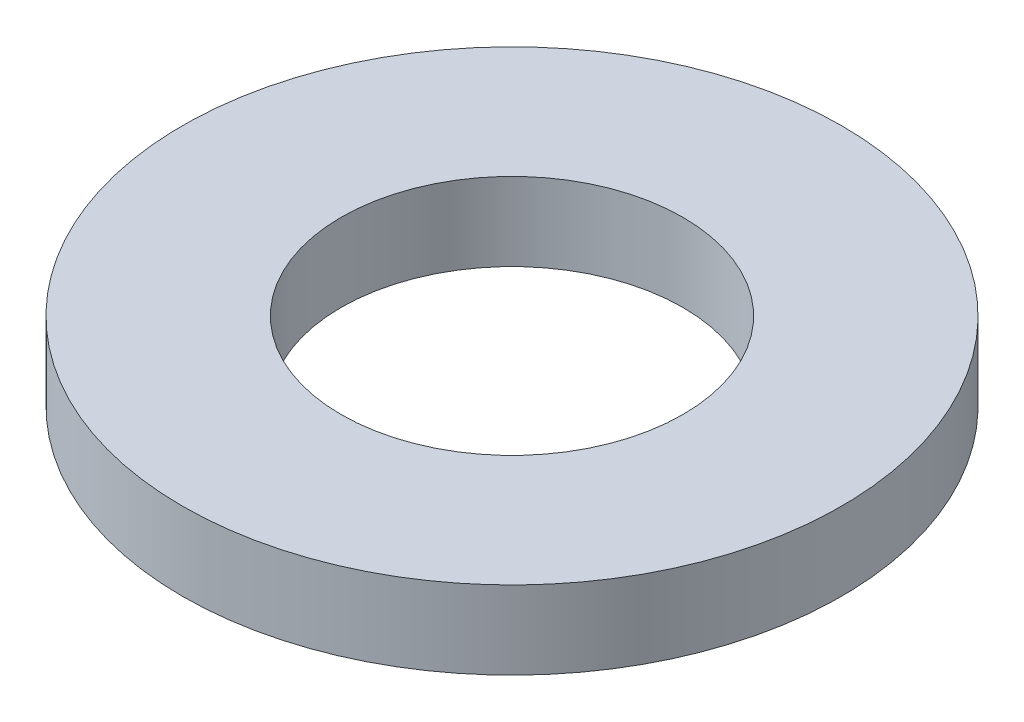
ISO-10303-21;
HEADER;
FILE_DESCRIPTION(('STEP AP214'),'2;1');
FILE_NAME('part.step','',(''),(''),'','','');
FILE_SCHEMA(('AUTOMOTIVE_DESIGN { 1 0 10303 214 1 1 1 1 }'));
ENDSEC;
DATA;
#1=APPLICATION_CONTEXT('core data for automotive mechanical design processes');
#2=APPLICATION_PROTOCOL_DEFINITION('international standard','automotive_design',2000,#1);
#3=PRODUCT_CONTEXT('',#1,'mechanical');
#4=PRODUCT('Part','Part','',(#3));
#5=PRODUCT_RELATED_PRODUCT_CATEGORY('part','',(#4));
#6=PRODUCT_DEFINITION_FORMATION('','',#4);
#7=PRODUCT_DEFINITION_CONTEXT('part definition',#1,'design');
#8=PRODUCT_DEFINITION('design','',#6,#7);
#9=PRODUCT_DEFINITION_SHAPE('','',#8);
#10=(LENGTH_UNIT() NAMED_UNIT(*) SI_UNIT(.MILLI.,.METRE.));
#11=(NAMED_UNIT(*) PLANE_ANGLE_UNIT() SI_UNIT($,.RADIAN.));
#12=(NAMED_UNIT(*) SI_UNIT($,.STERADIAN.) SOLID_ANGLE_UNIT());
#13=UNCERTAINTY_MEASURE_WITH_UNIT(LENGTH_MEASURE(1.E-05),#10,'distance_accuracy_value','');
#14=(GEOMETRIC_REPRESENTATION_CONTEXT(3) GLOBAL_UNCERTAINTY_ASSIGNED_CONTEXT((#13)) GLOBAL_UNIT_ASSIGNED_CONTEXT((#10,
#11,#12)) REPRESENTATION_CONTEXT('',''));
#15=CARTESIAN_POINT('',(0.,0.,0.));
#16=DIRECTION('',(0.,0.,1.));
#17=DIRECTION('',(1.,0.,0.));
#18=AXIS2_PLACEMENT_3D('',#15,#16,#17);
#19=CARTESIAN_POINT('',(0.,16.,0.));
#20=DIRECTION('',(0.,-1.,0.));
#21=DIRECTION('',(0.,0.,-1.));
#22=AXIS2_PLACEMENT_3D('',#19,#20,#21);
#23=CYLINDRICAL_SURFACE('',#22,67.5);
#24=CARTESIAN_POINT('',(0.,16.,0.));
#25=DIRECTION('',(0.,1.,0.));
#26=DIRECTION('',(0.,0.,1.));
#27=AXIS2_PLACEMENT_3D('',#24,#25,#26);
#28=CIRCLE('',#27,67.5);
#29=CARTESIAN_POINT('',(0.,16.,67.5));
#30=VERTEX_POINT('',#29);
#31=EDGE_CURVE('E10',#30,#30,#28,.T.);
#32=ORIENTED_EDGE('',*,*,#31,.F.);
#33=EDGE_LOOP('',(#32));
#34=FACE_BOUND('',#33,.T.);
#35=CARTESIAN_POINT('',(0.,0.,0.));
#36=DIRECTION('',(0.,1.,0.));
#37=DIRECTION('',(0.,0.,1.));
#38=AXIS2_PLACEMENT_3D('',#35,#36,#37);
#39=CIRCLE('',#38,67.5);
#40=CARTESIAN_POINT('',(0.,0.,67.5));
#41=VERTEX_POINT('',#40);
#42=EDGE_CURVE('E37',#41,#41,#39,.T.);
#43=ORIENTED_EDGE('',*,*,#42,.T.);
#44=EDGE_LOOP('',(#43));
#45=FACE_BOUND('',#44,.T.);
#46=ADVANCED_FACE('F40',(#34,#45),#23,.T.);
#47=CARTESIAN_POINT('',(0.,16.,0.));
#48=DIRECTION('',(0.,1.,0.));
#49=DIRECTION('',(0.,0.,1.));
#50=AXIS2_PLACEMENT_3D('',#47,#48,#49);
#51=PLANE('',#50);
#52=CARTESIAN_POINT('',(0.,16.,0.));
#53=DIRECTION('',(0.,1.,0.));
#54=DIRECTION('',(0.,0.,1.));
#55=AXIS2_PLACEMENT_3D('',#52,#53,#54);
#56=CIRCLE('',#55,35.);
#57=CARTESIAN_POINT('',(0.,16.,35.));
#58=VERTEX_POINT('',#57);
#59=EDGE_CURVE('E50',#58,#58,#56,.T.);
#60=ORIENTED_EDGE('',*,*,#59,.F.);
#61=EDGE_LOOP('',(#60));
#62=FACE_BOUND('',#61,.T.);
#63=ORIENTED_EDGE('',*,*,#31,.T.);
#64=EDGE_LOOP('',(#63));
#65=FACE_BOUND('',#64,.T.);
#66=ADVANCED_FACE('F59',(#62,#65),#51,.T.);
#67=CARTESIAN_POINT('',(0.,0.,0.));
#68=DIRECTION('',(0.,1.,0.));
#69=DIRECTION('',(0.,0.,1.));
#70=AXIS2_PLACEMENT_3D('',#67,#68,#69);
#71=PLANE('',#70);
#72=CARTESIAN_POINT('',(0.,0.,0.));
#73=DIRECTION('',(0.,1.,0.));
#74=DIRECTION('',(0.,0.,1.));
#75=AXIS2_PLACEMENT_3D('',#72,#73,#74);
#76=CIRCLE('',#75,35.);
#77=CARTESIAN_POINT('',(0.,0.,35.));
#78=VERTEX_POINT('',#77);
#79=EDGE_CURVE('E47',#78,#78,#76,.T.);
#80=ORIENTED_EDGE('',*,*,#79,.T.);
#81=EDGE_LOOP('',(#80));
#82=FACE_BOUND('',#81,.T.);
#83=ORIENTED_EDGE('',*,*,#42,.F.);
#84=EDGE_LOOP('',(#83));
#85=FACE_BOUND('',#84,.T.);
#86=ADVANCED_FACE('F58',(#82,#85),#71,.F.);
#87=CARTESIAN_POINT('',(0.,16.,0.));
#88=DIRECTION('',(0.,-1.,0.));
#89=DIRECTION('',(0.,0.,-1.));
#90=AXIS2_PLACEMENT_3D('',#87,#88,#89);
#91=CYLINDRICAL_SURFACE('',#90,35.);
#92=ORIENTED_EDGE('',*,*,#59,.T.);
#93=EDGE_LOOP('',(#92));
#94=FACE_BOUND('',#93,.T.);
#95=ORIENTED_EDGE('',*,*,#79,.F.);
#96=EDGE_LOOP('',(#95));
#97=FACE_BOUND('',#96,.T.);
#98=ADVANCED_FACE('F54',(#94,#97),#91,.F.);
#99=CLOSED_SHELL('',(#46,#66,#86,#98));
#100=MANIFOLD_SOLID_BREP('B2',#99);
#101=ADVANCED_BREP_SHAPE_REPRESENTATION('',(#18,#100),#14);
#102=SHAPE_DEFINITION_REPRESENTATION(#9,#101);
ENDSEC;
END-ISO-10303-21;
